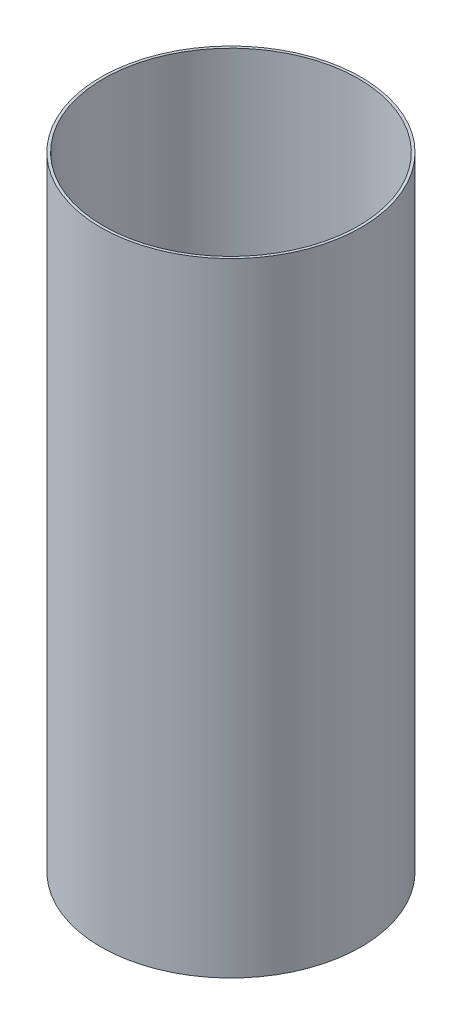
ISO-10303-21;
HEADER;
FILE_DESCRIPTION(('STEP AP214'),'2;1');
FILE_NAME('part.step','',(''),(''),'','','');
FILE_SCHEMA(('AUTOMOTIVE_DESIGN { 1 0 10303 214 1 1 1 1 }'));
ENDSEC;
DATA;
#1=APPLICATION_CONTEXT('core data for automotive mechanical design processes');
#2=APPLICATION_PROTOCOL_DEFINITION('international standard','automotive_design',2000,#1);
#3=PRODUCT_CONTEXT('',#1,'mechanical');
#4=PRODUCT('Part','Part','',(#3));
#5=PRODUCT_RELATED_PRODUCT_CATEGORY('part','',(#4));
#6=PRODUCT_DEFINITION_FORMATION('','',#4);
#7=PRODUCT_DEFINITION_CONTEXT('part definition',#1,'design');
#8=PRODUCT_DEFINITION('design','',#6,#7);
#9=PRODUCT_DEFINITION_SHAPE('','',#8);
#10=(LENGTH_UNIT() NAMED_UNIT(*) SI_UNIT(.MILLI.,.METRE.));
#11=(NAMED_UNIT(*) PLANE_ANGLE_UNIT() SI_UNIT($,.RADIAN.));
#12=(NAMED_UNIT(*) SI_UNIT($,.STERADIAN.) SOLID_ANGLE_UNIT());
#13=UNCERTAINTY_MEASURE_WITH_UNIT(LENGTH_MEASURE(1.E-05),#10,'distance_accuracy_value','');
#14=(GEOMETRIC_REPRESENTATION_CONTEXT(3) GLOBAL_UNCERTAINTY_ASSIGNED_CONTEXT((#13)) GLOBAL_UNIT_ASSIGNED_CONTEXT((#10,
#11,#12)) REPRESENTATION_CONTEXT('',''));
#15=CARTESIAN_POINT('',(0.,0.,0.));
#16=DIRECTION('',(0.,0.,1.));
#17=DIRECTION('',(1.,0.,0.));
#18=AXIS2_PLACEMENT_3D('',#15,#16,#17);
#19=CARTESIAN_POINT('',(0.,372.618,0.));
#20=DIRECTION('',(0.,1.,0.));
#21=DIRECTION('',(0.,0.,1.));
#22=AXIS2_PLACEMENT_3D('',#19,#20,#21);
#23=PLANE('',#22);
#24=CARTESIAN_POINT('',(0.,372.618,0.));
#25=DIRECTION('',(0.,1.,0.));
#26=DIRECTION('',(0.,0.,1.));
#27=AXIS2_PLACEMENT_3D('',#24,#25,#26);
#28=CIRCLE('',#27,77.8637);
#29=CARTESIAN_POINT('',(0.,372.618,77.8637));
#30=VERTEX_POINT('',#29);
#31=EDGE_CURVE('E10',#30,#30,#28,.T.);
#32=ORIENTED_EDGE('',*,*,#31,.T.);
#33=EDGE_LOOP('',(#32));
#34=FACE_BOUND('',#33,.T.);
#35=CARTESIAN_POINT('',(0.,372.618,0.));
#36=DIRECTION('',(0.,1.,0.));
#37=DIRECTION('',(0.,0.,1.));
#38=AXIS2_PLACEMENT_3D('',#35,#36,#37);
#39=CIRCLE('',#38,76.2889);
#40=CARTESIAN_POINT('',(0.,372.618,76.2889));
#41=VERTEX_POINT('',#40);
#42=EDGE_CURVE('E42',#41,#41,#39,.T.);
#43=ORIENTED_EDGE('',*,*,#42,.F.);
#44=EDGE_LOOP('',(#43));
#45=FACE_BOUND('',#44,.T.);
#46=ADVANCED_FACE('F31',(#34,#45),#23,.T.);
#47=CARTESIAN_POINT('',(0.,0.,0.));
#48=DIRECTION('',(0.,1.,0.));
#49=DIRECTION('',(0.,0.,1.));
#50=AXIS2_PLACEMENT_3D('',#47,#48,#49);
#51=PLANE('',#50);
#52=CARTESIAN_POINT('',(0.,0.,0.));
#53=DIRECTION('',(0.,1.,0.));
#54=DIRECTION('',(0.,0.,1.));
#55=AXIS2_PLACEMENT_3D('',#52,#53,#54);
#56=CIRCLE('',#55,77.8637);
#57=CARTESIAN_POINT('',(0.,0.,77.8637));
#58=VERTEX_POINT('',#57);
#59=EDGE_CURVE('E35',#58,#58,#56,.T.);
#60=ORIENTED_EDGE('',*,*,#59,.F.);
#61=EDGE_LOOP('',(#60));
#62=FACE_BOUND('',#61,.T.);
#63=CARTESIAN_POINT('',(0.,0.,0.));
#64=DIRECTION('',(0.,1.,0.));
#65=DIRECTION('',(0.,0.,1.));
#66=AXIS2_PLACEMENT_3D('',#63,#64,#65);
#67=CIRCLE('',#66,76.2889);
#68=CARTESIAN_POINT('',(0.,0.,76.2889));
#69=VERTEX_POINT('',#68);
#70=EDGE_CURVE('E44',#69,#69,#67,.T.);
#71=ORIENTED_EDGE('',*,*,#70,.T.);
#72=EDGE_LOOP('',(#71));
#73=FACE_BOUND('',#72,.T.);
#74=ADVANCED_FACE('F54',(#62,#73),#51,.F.);
#75=CARTESIAN_POINT('',(0.,372.618,0.));
#76=DIRECTION('',(0.,-1.,0.));
#77=DIRECTION('',(0.,0.,-1.));
#78=AXIS2_PLACEMENT_3D('',#75,#76,#77);
#79=CYLINDRICAL_SURFACE('',#78,77.8637);
#80=ORIENTED_EDGE('',*,*,#31,.F.);
#81=EDGE_LOOP('',(#80));
#82=FACE_BOUND('',#81,.T.);
#83=ORIENTED_EDGE('',*,*,#59,.T.);
#84=EDGE_LOOP('',(#83));
#85=FACE_BOUND('',#84,.T.);
#86=ADVANCED_FACE('F33',(#82,#85),#79,.T.);
#87=CARTESIAN_POINT('',(0.,372.618,0.));
#88=DIRECTION('',(0.,-1.,0.));
#89=DIRECTION('',(0.,0.,-1.));
#90=AXIS2_PLACEMENT_3D('',#87,#88,#89);
#91=CYLINDRICAL_SURFACE('',#90,76.2889);
#92=ORIENTED_EDGE('',*,*,#42,.T.);
#93=EDGE_LOOP('',(#92));
#94=FACE_BOUND('',#93,.T.);
#95=ORIENTED_EDGE('',*,*,#70,.F.);
#96=EDGE_LOOP('',(#95));
#97=FACE_BOUND('',#96,.T.);
#98=ADVANCED_FACE('F50',(#94,#97),#91,.F.);
#99=CLOSED_SHELL('',(#46,#74,#86,#98));
#100=MANIFOLD_SOLID_BREP('B2',#99);
#101=ADVANCED_BREP_SHAPE_REPRESENTATION('',(#18,#100),#14);
#102=SHAPE_DEFINITION_REPRESENTATION(#9,#101);
ENDSEC;
END-ISO-10303-21;
